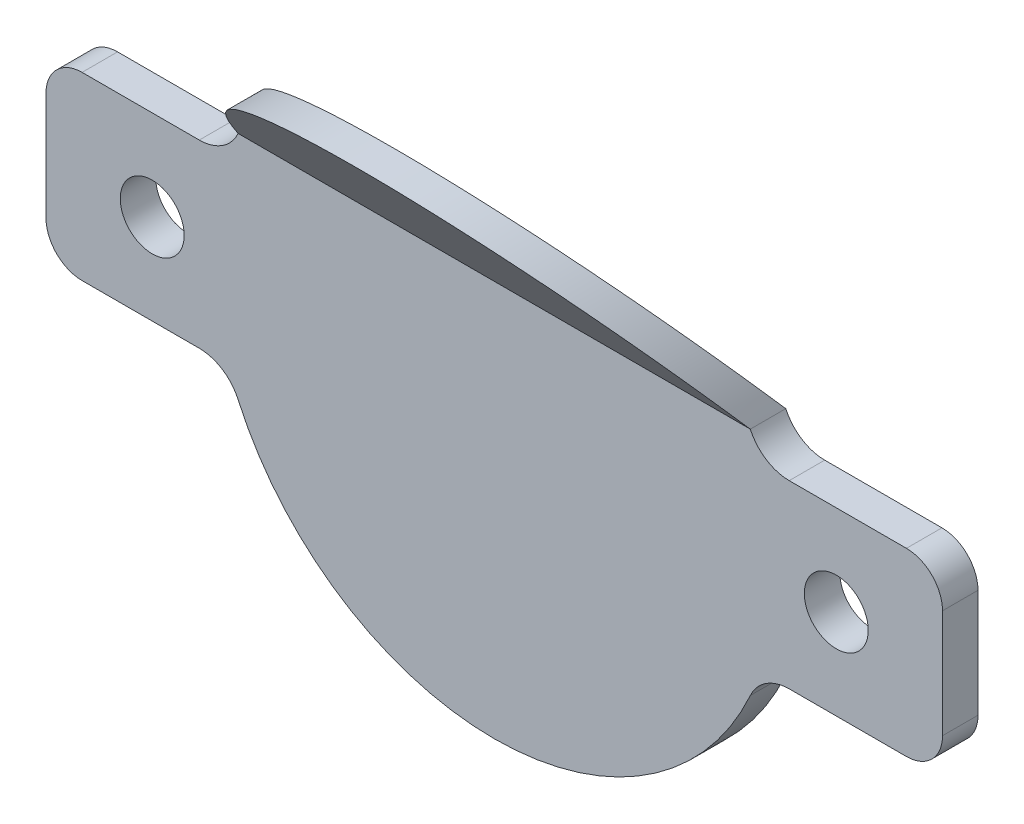
ISO-10303-21;
HEADER;
FILE_DESCRIPTION(('STEP AP214'),'2;1');
FILE_NAME('part.step','',(''),(''),'','','');
FILE_SCHEMA(('AUTOMOTIVE_DESIGN { 1 0 10303 214 1 1 1 1 }'));
ENDSEC;
DATA;
#1=APPLICATION_CONTEXT('core data for automotive mechanical design processes');
#2=APPLICATION_PROTOCOL_DEFINITION('international standard','automotive_design',2000,#1);
#3=PRODUCT_CONTEXT('',#1,'mechanical');
#4=PRODUCT('Part','Part','',(#3));
#5=PRODUCT_RELATED_PRODUCT_CATEGORY('part','',(#4));
#6=PRODUCT_DEFINITION_FORMATION('','',#4);
#7=PRODUCT_DEFINITION_CONTEXT('part definition',#1,'design');
#8=PRODUCT_DEFINITION('design','',#6,#7);
#9=PRODUCT_DEFINITION_SHAPE('','',#8);
#10=(LENGTH_UNIT() NAMED_UNIT(*) SI_UNIT(.MILLI.,.METRE.));
#11=(NAMED_UNIT(*) PLANE_ANGLE_UNIT() SI_UNIT($,.RADIAN.));
#12=(NAMED_UNIT(*) SI_UNIT($,.STERADIAN.) SOLID_ANGLE_UNIT());
#13=UNCERTAINTY_MEASURE_WITH_UNIT(LENGTH_MEASURE(1.E-05),#10,'distance_accuracy_value','');
#14=(GEOMETRIC_REPRESENTATION_CONTEXT(3) GLOBAL_UNCERTAINTY_ASSIGNED_CONTEXT((#13)) GLOBAL_UNIT_ASSIGNED_CONTEXT((#10,
#11,#12)) REPRESENTATION_CONTEXT('',''));
#15=CARTESIAN_POINT('',(0.,0.,0.));
#16=DIRECTION('',(0.,0.,1.));
#17=DIRECTION('',(1.,0.,0.));
#18=AXIS2_PLACEMENT_3D('',#15,#16,#17);
#19=CARTESIAN_POINT('',(17.5163864642521,21.969559393188,9.58000000000002));
#20=DIRECTION('',(0.,0.634780547963298,-0.772692471768307));
#21=DIRECTION('',(0.,0.772692471768307,0.634780547963298));
#22=AXIS2_PLACEMENT_3D('',#19,#20,#21);
#23=PLANE('',#22);
#24=CARTESIAN_POINT('',(-0.514545782896204,2.18955939318798,-6.66962025316452));
#25=DIRECTION('',(0.,0.634780547963298,-0.772692471768307));
#26=DIRECTION('',(0.,-0.772692471768307,-0.634780547963298));
#27=AXIS2_PLACEMENT_3D('',#24,#25,#26);
#28=ELLIPSE('',#27,25.5987999400764,19.78);
#29=CARTESIAN_POINT('',(-18.5516135357479,10.3082161096059,0.));
#30=VERTEX_POINT('',#29);
#31=CARTESIAN_POINT('',(17.5192464305192,10.3125425261282,0.00215433874896024));
#32=VERTEX_POINT('',#31);
#33=EDGE_CURVE('E185',#30,#32,#28,.T.);
#34=ORIENTED_EDGE('',*,*,#33,.T.);
#35=DIRECTION('',(1.,0.,0.));
#36=VECTOR('',#35,1.);
#37=CARTESIAN_POINT('',(0.,10.3082161096059,0.));
#38=LINE('',#37,#36);
#39=EDGE_CURVE('E206',#30,#32,#38,.T.);
#40=ORIENTED_EDGE('',*,*,#39,.F.);
#41=EDGE_LOOP('',(#34,#40));
#42=FACE_BOUND('',#41,.T.);
#43=ADVANCED_FACE('F57',(#42),#23,.T.);
#44=CARTESIAN_POINT('',(17.5163864642521,10.3082161096059,2.50000000000005));
#45=DIRECTION('',(0.,-0.634780547963298,0.772692471768307));
#46=DIRECTION('',(0.,-0.772692471768307,-0.634780547963298));
#47=AXIS2_PLACEMENT_3D('',#44,#45,#46);
#48=PLANE('',#47);
#49=DIRECTION('',(1.,0.,0.));
#50=VECTOR('',#49,1.);
#51=CARTESIAN_POINT('',(0.,10.3082161096059,2.5));
#52=LINE('',#51,#50);
#53=CARTESIAN_POINT('',(-18.5516135357479,10.3082161096059,2.50000000000001));
#54=VERTEX_POINT('',#53);
#55=CARTESIAN_POINT('',(17.5192464305192,10.3125425261282,2.50215433874897));
#56=VERTEX_POINT('',#55);
#57=EDGE_CURVE('E190',#54,#56,#52,.T.);
#58=ORIENTED_EDGE('',*,*,#57,.T.);
#59=CARTESIAN_POINT('',(-0.514545782896204,2.18955939318798,-4.16962025316452));
#60=DIRECTION('',(0.,-0.634780547963298,0.772692471768307));
#61=DIRECTION('',(0.,-0.772692471768307,-0.634780547963298));
#62=AXIS2_PLACEMENT_3D('',#59,#60,#61);
#63=ELLIPSE('',#62,25.5987999400764,19.78);
#64=EDGE_CURVE('E174',#56,#54,#63,.T.);
#65=ORIENTED_EDGE('',*,*,#64,.T.);
#66=EDGE_LOOP('',(#58,#65));
#67=FACE_BOUND('',#66,.T.);
#68=ADVANCED_FACE('F204',(#67),#48,.T.);
#69=CARTESIAN_POINT('',(0.,0.,2.5));
#70=DIRECTION('',(0.,0.,1.));
#71=DIRECTION('',(1.,0.,0.));
#72=AXIS2_PLACEMENT_3D('',#69,#70,#71);
#73=PLANE('',#72);
#74=CARTESIAN_POINT('',(-24.6024947889799,2.18955939318799,2.5));
#75=DIRECTION('',(0.,0.,1.));
#76=DIRECTION('',(1.,0.,0.));
#77=AXIS2_PLACEMENT_3D('',#74,#75,#76);
#78=CIRCLE('',#77,2.24999999999999);
#79=CARTESIAN_POINT('',(-22.3524947889799,2.18955939318799,2.5));
#80=VERTEX_POINT('',#79);
#81=EDGE_CURVE('E230',#80,#80,#78,.T.);
#82=ORIENTED_EDGE('',*,*,#81,.F.);
#83=EDGE_LOOP('',(#82));
#84=FACE_BOUND('',#83,.T.);
#85=CARTESIAN_POINT('',(23.5734032231875,2.18955939318799,2.5));
#86=DIRECTION('',(0.,0.,1.));
#87=DIRECTION('',(1.,0.,0.));
#88=AXIS2_PLACEMENT_3D('',#85,#86,#87);
#89=CIRCLE('',#88,2.24999999999999);
#90=CARTESIAN_POINT('',(25.8234032231875,2.18955939318799,2.5));
#91=VERTEX_POINT('',#90);
#92=EDGE_CURVE('E237',#91,#91,#89,.T.);
#93=ORIENTED_EDGE('',*,*,#92,.F.);
#94=EDGE_LOOP('',(#93));
#95=FACE_BOUND('',#94,.T.);
#96=CARTESIAN_POINT('',(20.2581743086084,11.539559393188,2.5));
#97=DIRECTION('',(0.,0.,1.));
#98=DIRECTION('',(1.,0.,0.));
#99=AXIS2_PLACEMENT_3D('',#96,#97,#98);
#100=CIRCLE('',#99,3.);
#101=CARTESIAN_POINT('',(20.2581743086084,8.53955939318799,2.5));
#102=VERTEX_POINT('',#101);
#103=EDGE_CURVE('E188',#102,#56,#100,.F.);
#104=ORIENTED_EDGE('',*,*,#103,.T.);
#105=ORIENTED_EDGE('',*,*,#57,.F.);
#106=CARTESIAN_POINT('',(-21.2872658744008,11.539559393188,2.5));
#107=DIRECTION('',(0.,0.,1.));
#108=DIRECTION('',(1.,0.,0.));
#109=AXIS2_PLACEMENT_3D('',#106,#107,#108);
#110=CIRCLE('',#109,3.);
#111=CARTESIAN_POINT('',(-21.2872658744008,8.53955939318799,2.5));
#112=VERTEX_POINT('',#111);
#113=EDGE_CURVE('E66',#54,#112,#110,.F.);
#114=ORIENTED_EDGE('',*,*,#113,.T.);
#115=DIRECTION('',(1.,0.,0.));
#116=VECTOR('',#115,1.);
#117=CARTESIAN_POINT('',(0.,8.53955939318799,2.5));
#118=LINE('',#117,#116);
#119=CARTESIAN_POINT('',(-29.5430388201736,8.53955939318799,2.5));
#120=VERTEX_POINT('',#119);
#121=EDGE_CURVE('E253',#120,#112,#118,.T.);
#122=ORIENTED_EDGE('',*,*,#121,.F.);
#123=CARTESIAN_POINT('',(-29.5430388201736,5.99955939318799,2.5));
#124=DIRECTION('',(0.,0.,1.));
#125=DIRECTION('',(1.,0.,0.));
#126=AXIS2_PLACEMENT_3D('',#123,#124,#125);
#127=CIRCLE('',#126,2.54);
#128=CARTESIAN_POINT('',(-32.0830388201736,5.99955939318799,2.5));
#129=VERTEX_POINT('',#128);
#130=EDGE_CURVE('E292',#120,#129,#127,.T.);
#131=ORIENTED_EDGE('',*,*,#130,.T.);
#132=DIRECTION('',(0.,1.,0.));
#133=VECTOR('',#132,1.);
#134=CARTESIAN_POINT('',(-32.0830388201736,0.,2.5));
#135=LINE('',#134,#133);
#136=CARTESIAN_POINT('',(-32.0830388201736,-1.62044060681201,2.5));
#137=VERTEX_POINT('',#136);
#138=EDGE_CURVE('E255',#137,#129,#135,.T.);
#139=ORIENTED_EDGE('',*,*,#138,.F.);
#140=CARTESIAN_POINT('',(-29.5430388201736,-1.62044060681201,2.5));
#141=DIRECTION('',(0.,0.,1.));
#142=DIRECTION('',(1.,0.,0.));
#143=AXIS2_PLACEMENT_3D('',#140,#141,#142);
#144=CIRCLE('',#143,2.54);
#145=CARTESIAN_POINT('',(-29.5430388201736,-4.16044060681201,2.5));
#146=VERTEX_POINT('',#145);
#147=EDGE_CURVE('E294',#137,#146,#144,.T.);
#148=ORIENTED_EDGE('',*,*,#147,.T.);
#149=DIRECTION('',(-1.,0.,0.));
#150=VECTOR('',#149,1.);
#151=CARTESIAN_POINT('',(0.,-4.16044060681201,2.5));
#152=LINE('',#151,#150);
#153=CARTESIAN_POINT('',(-21.2872658744008,-4.16044060681201,2.5));
#154=VERTEX_POINT('',#153);
#155=EDGE_CURVE('E244',#154,#146,#152,.T.);
#156=ORIENTED_EDGE('',*,*,#155,.F.);
#157=CARTESIAN_POINT('',(-21.2872658744008,-7.16044060681201,2.5));
#158=DIRECTION('',(0.,0.,1.));
#159=DIRECTION('',(1.,0.,0.));
#160=AXIS2_PLACEMENT_3D('',#157,#158,#159);
#161=CIRCLE('',#160,3.);
#162=CARTESIAN_POINT('',(-18.5516135357479,-5.92909732322992,2.5));
#163=VERTEX_POINT('',#162);
#164=EDGE_CURVE('E223',#154,#163,#161,.F.);
#165=ORIENTED_EDGE('',*,*,#164,.T.);
#166=CARTESIAN_POINT('',(-0.514545782896191,2.18955939318799,2.5));
#167=DIRECTION('',(0.,0.,1.));
#168=DIRECTION('',(1.,0.,0.));
#169=AXIS2_PLACEMENT_3D('',#166,#167,#168);
#170=CIRCLE('',#169,19.78);
#171=CARTESIAN_POINT('',(17.5225219699555,-5.92909732322992,2.5));
#172=VERTEX_POINT('',#171);
#173=EDGE_CURVE('E205',#163,#172,#170,.T.);
#174=ORIENTED_EDGE('',*,*,#173,.T.);
#175=CARTESIAN_POINT('',(20.2581743086084,-7.16044060681201,2.5));
#176=DIRECTION('',(0.,0.,1.));
#177=DIRECTION('',(1.,0.,0.));
#178=AXIS2_PLACEMENT_3D('',#175,#176,#177);
#179=CIRCLE('',#178,3.);
#180=CARTESIAN_POINT('',(20.2581743086084,-4.16044060681201,2.5));
#181=VERTEX_POINT('',#180);
#182=EDGE_CURVE('E323',#172,#181,#179,.F.);
#183=ORIENTED_EDGE('',*,*,#182,.T.);
#184=DIRECTION('',(1.,0.,0.));
#185=VECTOR('',#184,1.);
#186=CARTESIAN_POINT('',(0.,-4.16044060681201,2.5));
#187=LINE('',#186,#185);
#188=CARTESIAN_POINT('',(28.5139472543812,-4.16044060681201,2.5));
#189=VERTEX_POINT('',#188);
#190=EDGE_CURVE('E246',#181,#189,#187,.T.);
#191=ORIENTED_EDGE('',*,*,#190,.T.);
#192=CARTESIAN_POINT('',(28.5139472543812,-1.62044060681201,2.5));
#193=DIRECTION('',(0.,0.,1.));
#194=DIRECTION('',(1.,0.,0.));
#195=AXIS2_PLACEMENT_3D('',#192,#193,#194);
#196=CIRCLE('',#195,2.54);
#197=CARTESIAN_POINT('',(31.0539472543812,-1.62044060681201,2.5));
#198=VERTEX_POINT('',#197);
#199=EDGE_CURVE('E288',#189,#198,#196,.T.);
#200=ORIENTED_EDGE('',*,*,#199,.T.);
#201=DIRECTION('',(0.,1.,0.));
#202=VECTOR('',#201,1.);
#203=CARTESIAN_POINT('',(31.0539472543812,0.,2.5));
#204=LINE('',#203,#202);
#205=CARTESIAN_POINT('',(31.0539472543812,5.99955939318799,2.5));
#206=VERTEX_POINT('',#205);
#207=EDGE_CURVE('E249',#198,#206,#204,.T.);
#208=ORIENTED_EDGE('',*,*,#207,.T.);
#209=CARTESIAN_POINT('',(28.5139472543812,5.99955939318799,2.5));
#210=DIRECTION('',(0.,0.,1.));
#211=DIRECTION('',(1.,0.,0.));
#212=AXIS2_PLACEMENT_3D('',#209,#210,#211);
#213=CIRCLE('',#212,2.54);
#214=CARTESIAN_POINT('',(28.5139472543812,8.53955939318799,2.5));
#215=VERTEX_POINT('',#214);
#216=EDGE_CURVE('E290',#206,#215,#213,.T.);
#217=ORIENTED_EDGE('',*,*,#216,.T.);
#218=DIRECTION('',(-1.,0.,0.));
#219=VECTOR('',#218,1.);
#220=CARTESIAN_POINT('',(0.,8.53955939318799,2.5));
#221=LINE('',#220,#219);
#222=EDGE_CURVE('E192',#215,#102,#221,.T.);
#223=ORIENTED_EDGE('',*,*,#222,.T.);
#224=EDGE_LOOP('',(#104,#105,#114,#122,#131,#139,#148,#156,#165,#174,#183,#191,#200,#208,#217,#223));
#225=FACE_BOUND('',#224,.T.);
#226=ADVANCED_FACE('F189',(#84,#95,#225),#73,.T.);
#227=CARTESIAN_POINT('',(0.,0.,0.));
#228=DIRECTION('',(0.,0.,1.));
#229=DIRECTION('',(1.,0.,0.));
#230=AXIS2_PLACEMENT_3D('',#227,#228,#229);
#231=PLANE('',#230);
#232=CARTESIAN_POINT('',(23.5734032231875,2.18955939318799,0.));
#233=DIRECTION('',(0.,0.,1.));
#234=DIRECTION('',(1.,0.,0.));
#235=AXIS2_PLACEMENT_3D('',#232,#233,#234);
#236=CIRCLE('',#235,2.25);
#237=CARTESIAN_POINT('',(25.8234032231875,2.18955939318799,0.));
#238=VERTEX_POINT('',#237);
#239=EDGE_CURVE('E240',#238,#238,#236,.T.);
#240=ORIENTED_EDGE('',*,*,#239,.T.);
#241=EDGE_LOOP('',(#240));
#242=FACE_BOUND('',#241,.T.);
#243=CARTESIAN_POINT('',(-24.6024947889799,2.18955939318799,0.));
#244=DIRECTION('',(0.,0.,1.));
#245=DIRECTION('',(1.,0.,0.));
#246=AXIS2_PLACEMENT_3D('',#243,#244,#245);
#247=CIRCLE('',#246,2.25);
#248=CARTESIAN_POINT('',(-22.3524947889799,2.18955939318799,0.));
#249=VERTEX_POINT('',#248);
#250=EDGE_CURVE('E234',#249,#249,#247,.T.);
#251=ORIENTED_EDGE('',*,*,#250,.T.);
#252=EDGE_LOOP('',(#251));
#253=FACE_BOUND('',#252,.T.);
#254=ORIENTED_EDGE('',*,*,#39,.T.);
#255=CARTESIAN_POINT('',(20.2581743086084,11.539559393188,0.));
#256=DIRECTION('',(0.,0.,1.));
#257=DIRECTION('',(1.,0.,0.));
#258=AXIS2_PLACEMENT_3D('',#255,#256,#257);
#259=CIRCLE('',#258,3.);
#260=CARTESIAN_POINT('',(20.2581743086084,8.53955939318799,0.));
#261=VERTEX_POINT('',#260);
#262=EDGE_CURVE('E196',#32,#261,#259,.T.);
#263=ORIENTED_EDGE('',*,*,#262,.T.);
#264=DIRECTION('',(-1.,0.,0.));
#265=VECTOR('',#264,1.);
#266=CARTESIAN_POINT('',(0.,8.53955939318799,0.));
#267=LINE('',#266,#265);
#268=CARTESIAN_POINT('',(28.5139472543812,8.53955939318799,0.));
#269=VERTEX_POINT('',#268);
#270=EDGE_CURVE('E265',#269,#261,#267,.T.);
#271=ORIENTED_EDGE('',*,*,#270,.F.);
#272=CARTESIAN_POINT('',(28.5139472543812,5.99955939318799,0.));
#273=DIRECTION('',(0.,0.,1.));
#274=DIRECTION('',(1.,0.,0.));
#275=AXIS2_PLACEMENT_3D('',#272,#273,#274);
#276=CIRCLE('',#275,2.54);
#277=CARTESIAN_POINT('',(31.0539472543812,5.99955939318799,0.));
#278=VERTEX_POINT('',#277);
#279=EDGE_CURVE('E277',#269,#278,#276,.F.);
#280=ORIENTED_EDGE('',*,*,#279,.T.);
#281=DIRECTION('',(0.,1.,0.));
#282=VECTOR('',#281,1.);
#283=CARTESIAN_POINT('',(31.0539472543812,0.,0.));
#284=LINE('',#283,#282);
#285=CARTESIAN_POINT('',(31.0539472543812,-1.62044060681201,0.));
#286=VERTEX_POINT('',#285);
#287=EDGE_CURVE('E262',#286,#278,#284,.T.);
#288=ORIENTED_EDGE('',*,*,#287,.F.);
#289=CARTESIAN_POINT('',(28.5139472543812,-1.62044060681201,0.));
#290=DIRECTION('',(0.,0.,1.));
#291=DIRECTION('',(1.,0.,0.));
#292=AXIS2_PLACEMENT_3D('',#289,#290,#291);
#293=CIRCLE('',#292,2.54);
#294=CARTESIAN_POINT('',(28.5139472543812,-4.16044060681201,0.));
#295=VERTEX_POINT('',#294);
#296=EDGE_CURVE('E274',#286,#295,#293,.F.);
#297=ORIENTED_EDGE('',*,*,#296,.T.);
#298=DIRECTION('',(1.,0.,0.));
#299=VECTOR('',#298,1.);
#300=CARTESIAN_POINT('',(0.,-4.16044060681201,0.));
#301=LINE('',#300,#299);
#302=CARTESIAN_POINT('',(20.2581743086084,-4.16044060681201,0.));
#303=VERTEX_POINT('',#302);
#304=EDGE_CURVE('E260',#303,#295,#301,.T.);
#305=ORIENTED_EDGE('',*,*,#304,.F.);
#306=CARTESIAN_POINT('',(20.2581743086084,-7.16044060681201,0.));
#307=DIRECTION('',(0.,0.,1.));
#308=DIRECTION('',(1.,0.,0.));
#309=AXIS2_PLACEMENT_3D('',#306,#307,#308);
#310=CIRCLE('',#309,3.);
#311=CARTESIAN_POINT('',(17.5225219699555,-5.92909732322992,0.));
#312=VERTEX_POINT('',#311);
#313=EDGE_CURVE('E197',#303,#312,#310,.T.);
#314=ORIENTED_EDGE('',*,*,#313,.T.);
#315=CARTESIAN_POINT('',(-0.514545782896191,2.18955939318799,0.));
#316=DIRECTION('',(0.,0.,1.));
#317=DIRECTION('',(1.,0.,0.));
#318=AXIS2_PLACEMENT_3D('',#315,#316,#317);
#319=CIRCLE('',#318,19.78);
#320=CARTESIAN_POINT('',(-18.5516135357479,-5.92909732322992,0.));
#321=VERTEX_POINT('',#320);
#322=EDGE_CURVE('E209',#321,#312,#319,.T.);
#323=ORIENTED_EDGE('',*,*,#322,.F.);
#324=CARTESIAN_POINT('',(-21.2872658744008,-7.16044060681201,0.));
#325=DIRECTION('',(0.,0.,1.));
#326=DIRECTION('',(1.,0.,0.));
#327=AXIS2_PLACEMENT_3D('',#324,#325,#326);
#328=CIRCLE('',#327,3.);
#329=CARTESIAN_POINT('',(-21.2872658744008,-4.16044060681201,0.));
#330=VERTEX_POINT('',#329);
#331=EDGE_CURVE('E327',#321,#330,#328,.T.);
#332=ORIENTED_EDGE('',*,*,#331,.T.);
#333=DIRECTION('',(-1.,0.,0.));
#334=VECTOR('',#333,1.);
#335=CARTESIAN_POINT('',(0.,-4.16044060681201,0.));
#336=LINE('',#335,#334);
#337=CARTESIAN_POINT('',(-29.5430388201736,-4.16044060681201,0.));
#338=VERTEX_POINT('',#337);
#339=EDGE_CURVE('E243',#330,#338,#336,.T.);
#340=ORIENTED_EDGE('',*,*,#339,.T.);
#341=CARTESIAN_POINT('',(-29.5430388201736,-1.62044060681201,0.));
#342=DIRECTION('',(0.,0.,1.));
#343=DIRECTION('',(1.,0.,0.));
#344=AXIS2_PLACEMENT_3D('',#341,#342,#343);
#345=CIRCLE('',#344,2.54);
#346=CARTESIAN_POINT('',(-32.0830388201736,-1.62044060681201,0.));
#347=VERTEX_POINT('',#346);
#348=EDGE_CURVE('E281',#338,#347,#345,.F.);
#349=ORIENTED_EDGE('',*,*,#348,.T.);
#350=DIRECTION('',(0.,1.,0.));
#351=VECTOR('',#350,1.);
#352=CARTESIAN_POINT('',(-32.0830388201736,0.,0.));
#353=LINE('',#352,#351);
#354=CARTESIAN_POINT('',(-32.0830388201736,5.99955939318799,0.));
#355=VERTEX_POINT('',#354);
#356=EDGE_CURVE('E247',#347,#355,#353,.T.);
#357=ORIENTED_EDGE('',*,*,#356,.T.);
#358=CARTESIAN_POINT('',(-29.5430388201736,5.99955939318799,0.));
#359=DIRECTION('',(0.,0.,1.));
#360=DIRECTION('',(1.,0.,0.));
#361=AXIS2_PLACEMENT_3D('',#358,#359,#360);
#362=CIRCLE('',#361,2.54);
#363=CARTESIAN_POINT('',(-29.5430388201736,8.53955939318799,0.));
#364=VERTEX_POINT('',#363);
#365=EDGE_CURVE('E279',#355,#364,#362,.F.);
#366=ORIENTED_EDGE('',*,*,#365,.T.);
#367=DIRECTION('',(1.,0.,0.));
#368=VECTOR('',#367,1.);
#369=CARTESIAN_POINT('',(0.,8.53955939318799,0.));
#370=LINE('',#369,#368);
#371=CARTESIAN_POINT('',(-21.2872658744008,8.53955939318799,0.));
#372=VERTEX_POINT('',#371);
#373=EDGE_CURVE('E268',#364,#372,#370,.T.);
#374=ORIENTED_EDGE('',*,*,#373,.T.);
#375=CARTESIAN_POINT('',(-21.2872658744008,11.539559393188,0.));
#376=DIRECTION('',(0.,0.,1.));
#377=DIRECTION('',(1.,0.,0.));
#378=AXIS2_PLACEMENT_3D('',#375,#376,#377);
#379=CIRCLE('',#378,3.);
#380=EDGE_CURVE('E12',#372,#30,#379,.T.);
#381=ORIENTED_EDGE('',*,*,#380,.T.);
#382=EDGE_LOOP('',(#254,#263,#271,#280,#288,#297,#305,#314,#323,#332,#340,#349,#357,#366,#374,#381));
#383=FACE_BOUND('',#382,.T.);
#384=ADVANCED_FACE('F333',(#242,#253,#383),#231,.F.);
#385=CARTESIAN_POINT('',(0.,-4.16044060681201,2.5));
#386=DIRECTION('',(0.,-1.,0.));
#387=DIRECTION('',(0.,0.,-1.));
#388=AXIS2_PLACEMENT_3D('',#385,#386,#387);
#389=PLANE('',#388);
#390=ORIENTED_EDGE('',*,*,#339,.F.);
#391=DIRECTION('',(0.,0.,-1.));
#392=VECTOR('',#391,1.);
#393=CARTESIAN_POINT('',(-21.2872658744008,-4.16044060681201,2.5));
#394=LINE('',#393,#392);
#395=EDGE_CURVE('E202',#330,#154,#394,.F.);
#396=ORIENTED_EDGE('',*,*,#395,.T.);
#397=ORIENTED_EDGE('',*,*,#155,.T.);
#398=DIRECTION('',(0.,0.,-1.));
#399=VECTOR('',#398,1.);
#400=CARTESIAN_POINT('',(-29.5430388201736,-4.16044060681201,2.5));
#401=LINE('',#400,#399);
#402=EDGE_CURVE('E258',#146,#338,#401,.T.);
#403=ORIENTED_EDGE('',*,*,#402,.T.);
#404=EDGE_LOOP('',(#390,#396,#397,#403));
#405=FACE_BOUND('',#404,.T.);
#406=ADVANCED_FACE('F339',(#405),#389,.T.);
#407=CARTESIAN_POINT('',(0.,-4.16044060681201,2.5));
#408=DIRECTION('',(0.,1.,0.));
#409=DIRECTION('',(0.,0.,1.));
#410=AXIS2_PLACEMENT_3D('',#407,#408,#409);
#411=PLANE('',#410);
#412=ORIENTED_EDGE('',*,*,#190,.F.);
#413=DIRECTION('',(0.,0.,1.));
#414=VECTOR('',#413,1.);
#415=CARTESIAN_POINT('',(20.2581743086084,-4.16044060681201,2.5));
#416=LINE('',#415,#414);
#417=EDGE_CURVE('E315',#181,#303,#416,.F.);
#418=ORIENTED_EDGE('',*,*,#417,.T.);
#419=ORIENTED_EDGE('',*,*,#304,.T.);
#420=DIRECTION('',(0.,0.,-1.));
#421=VECTOR('',#420,1.);
#422=CARTESIAN_POINT('',(28.5139472543812,-4.16044060681201,2.5));
#423=LINE('',#422,#421);
#424=EDGE_CURVE('E307',#295,#189,#423,.F.);
#425=ORIENTED_EDGE('',*,*,#424,.T.);
#426=EDGE_LOOP('',(#412,#418,#419,#425));
#427=FACE_BOUND('',#426,.T.);
#428=ADVANCED_FACE('F353',(#427),#411,.F.);
#429=CARTESIAN_POINT('',(31.0539472543812,0.,2.5));
#430=DIRECTION('',(-1.,0.,0.));
#431=DIRECTION('',(0.,0.,1.));
#432=AXIS2_PLACEMENT_3D('',#429,#430,#431);
#433=PLANE('',#432);
#434=ORIENTED_EDGE('',*,*,#287,.T.);
#435=DIRECTION('',(0.,0.,-1.));
#436=VECTOR('',#435,1.);
#437=CARTESIAN_POINT('',(31.0539472543812,5.99955939318799,2.5));
#438=LINE('',#437,#436);
#439=EDGE_CURVE('E305',#278,#206,#438,.F.);
#440=ORIENTED_EDGE('',*,*,#439,.T.);
#441=ORIENTED_EDGE('',*,*,#207,.F.);
#442=DIRECTION('',(0.,0.,-1.));
#443=VECTOR('',#442,1.);
#444=CARTESIAN_POINT('',(31.0539472543812,-1.62044060681201,2.5));
#445=LINE('',#444,#443);
#446=EDGE_CURVE('E302',#198,#286,#445,.T.);
#447=ORIENTED_EDGE('',*,*,#446,.T.);
#448=EDGE_LOOP('',(#434,#440,#441,#447));
#449=FACE_BOUND('',#448,.T.);
#450=ADVANCED_FACE('F363',(#449),#433,.F.);
#451=CARTESIAN_POINT('',(0.,8.53955939318799,2.5));
#452=DIRECTION('',(0.,-1.,0.));
#453=DIRECTION('',(0.,0.,-1.));
#454=AXIS2_PLACEMENT_3D('',#451,#452,#453);
#455=PLANE('',#454);
#456=ORIENTED_EDGE('',*,*,#270,.T.);
#457=DIRECTION('',(0.,0.,1.));
#458=VECTOR('',#457,1.);
#459=CARTESIAN_POINT('',(20.2581743086084,8.53955939318799,2.5));
#460=LINE('',#459,#458);
#461=EDGE_CURVE('E317',#261,#102,#460,.T.);
#462=ORIENTED_EDGE('',*,*,#461,.T.);
#463=ORIENTED_EDGE('',*,*,#222,.F.);
#464=DIRECTION('',(0.,0.,-1.));
#465=VECTOR('',#464,1.);
#466=CARTESIAN_POINT('',(28.5139472543812,8.53955939318799,2.5));
#467=LINE('',#466,#465);
#468=EDGE_CURVE('E299',#215,#269,#467,.T.);
#469=ORIENTED_EDGE('',*,*,#468,.T.);
#470=EDGE_LOOP('',(#456,#462,#463,#469));
#471=FACE_BOUND('',#470,.T.);
#472=ADVANCED_FACE('F370',(#471),#455,.F.);
#473=CARTESIAN_POINT('',(0.,8.53955939318799,2.5));
#474=DIRECTION('',(0.,1.,0.));
#475=DIRECTION('',(0.,0.,1.));
#476=AXIS2_PLACEMENT_3D('',#473,#474,#475);
#477=PLANE('',#476);
#478=ORIENTED_EDGE('',*,*,#121,.T.);
#479=DIRECTION('',(0.,0.,-1.));
#480=VECTOR('',#479,1.);
#481=CARTESIAN_POINT('',(-21.2872658744008,8.53955939318799,0.));
#482=LINE('',#481,#480);
#483=EDGE_CURVE('E80',#112,#372,#482,.T.);
#484=ORIENTED_EDGE('',*,*,#483,.T.);
#485=ORIENTED_EDGE('',*,*,#373,.F.);
#486=DIRECTION('',(0.,0.,-1.));
#487=VECTOR('',#486,1.);
#488=CARTESIAN_POINT('',(-29.5430388201736,8.53955939318799,2.5));
#489=LINE('',#488,#487);
#490=EDGE_CURVE('E297',#364,#120,#489,.F.);
#491=ORIENTED_EDGE('',*,*,#490,.T.);
#492=EDGE_LOOP('',(#478,#484,#485,#491));
#493=FACE_BOUND('',#492,.T.);
#494=ADVANCED_FACE('F410',(#493),#477,.T.);
#495=CARTESIAN_POINT('',(-32.0830388201736,0.,2.5));
#496=DIRECTION('',(-1.,0.,0.));
#497=DIRECTION('',(0.,0.,1.));
#498=AXIS2_PLACEMENT_3D('',#495,#496,#497);
#499=PLANE('',#498);
#500=ORIENTED_EDGE('',*,*,#356,.F.);
#501=DIRECTION('',(0.,0.,-1.));
#502=VECTOR('',#501,1.);
#503=CARTESIAN_POINT('',(-32.0830388201736,-1.62044060681201,2.5));
#504=LINE('',#503,#502);
#505=EDGE_CURVE('E286',#347,#137,#504,.F.);
#506=ORIENTED_EDGE('',*,*,#505,.T.);
#507=ORIENTED_EDGE('',*,*,#138,.T.);
#508=DIRECTION('',(0.,0.,-1.));
#509=VECTOR('',#508,1.);
#510=CARTESIAN_POINT('',(-32.0830388201736,5.99955939318799,2.5));
#511=LINE('',#510,#509);
#512=EDGE_CURVE('E283',#129,#355,#511,.T.);
#513=ORIENTED_EDGE('',*,*,#512,.T.);
#514=EDGE_LOOP('',(#500,#506,#507,#513));
#515=FACE_BOUND('',#514,.T.);
#516=ADVANCED_FACE('F406',(#515),#499,.T.);
#517=CARTESIAN_POINT('',(-29.5430388201736,-1.62044060681201,2.5));
#518=DIRECTION('',(0.,0.,-1.));
#519=DIRECTION('',(-1.,0.,0.));
#520=AXIS2_PLACEMENT_3D('',#517,#518,#519);
#521=CYLINDRICAL_SURFACE('',#520,2.54);
#522=ORIENTED_EDGE('',*,*,#147,.F.);
#523=ORIENTED_EDGE('',*,*,#505,.F.);
#524=ORIENTED_EDGE('',*,*,#348,.F.);
#525=ORIENTED_EDGE('',*,*,#402,.F.);
#526=EDGE_LOOP('',(#522,#523,#524,#525));
#527=FACE_BOUND('',#526,.T.);
#528=ADVANCED_FACE('F409',(#527),#521,.T.);
#529=CARTESIAN_POINT('',(-29.5430388201736,5.99955939318799,2.5));
#530=DIRECTION('',(0.,0.,-1.));
#531=DIRECTION('',(-1.,0.,0.));
#532=AXIS2_PLACEMENT_3D('',#529,#530,#531);
#533=CYLINDRICAL_SURFACE('',#532,2.54);
#534=ORIENTED_EDGE('',*,*,#130,.F.);
#535=ORIENTED_EDGE('',*,*,#490,.F.);
#536=ORIENTED_EDGE('',*,*,#365,.F.);
#537=ORIENTED_EDGE('',*,*,#512,.F.);
#538=EDGE_LOOP('',(#534,#535,#536,#537));
#539=FACE_BOUND('',#538,.T.);
#540=ADVANCED_FACE('F424',(#539),#533,.T.);
#541=CARTESIAN_POINT('',(28.5139472543812,5.99955939318799,2.5));
#542=DIRECTION('',(0.,0.,-1.));
#543=DIRECTION('',(-1.,0.,0.));
#544=AXIS2_PLACEMENT_3D('',#541,#542,#543);
#545=CYLINDRICAL_SURFACE('',#544,2.54);
#546=ORIENTED_EDGE('',*,*,#216,.F.);
#547=ORIENTED_EDGE('',*,*,#439,.F.);
#548=ORIENTED_EDGE('',*,*,#279,.F.);
#549=ORIENTED_EDGE('',*,*,#468,.F.);
#550=EDGE_LOOP('',(#546,#547,#548,#549));
#551=FACE_BOUND('',#550,.T.);
#552=ADVANCED_FACE('F367',(#551),#545,.T.);
#553=CARTESIAN_POINT('',(28.5139472543812,-1.62044060681201,2.5));
#554=DIRECTION('',(0.,0.,-1.));
#555=DIRECTION('',(-1.,0.,0.));
#556=AXIS2_PLACEMENT_3D('',#553,#554,#555);
#557=CYLINDRICAL_SURFACE('',#556,2.54);
#558=ORIENTED_EDGE('',*,*,#199,.F.);
#559=ORIENTED_EDGE('',*,*,#424,.F.);
#560=ORIENTED_EDGE('',*,*,#296,.F.);
#561=ORIENTED_EDGE('',*,*,#446,.F.);
#562=EDGE_LOOP('',(#558,#559,#560,#561));
#563=FACE_BOUND('',#562,.T.);
#564=ADVANCED_FACE('F359',(#563),#557,.T.);
#565=CARTESIAN_POINT('',(23.5734032231875,2.18955939318799,2.5));
#566=DIRECTION('',(0.,0.,1.));
#567=DIRECTION('',(1.,0.,0.));
#568=AXIS2_PLACEMENT_3D('',#565,#566,#567);
#569=CYLINDRICAL_SURFACE('',#568,2.24999999999999);
#570=ORIENTED_EDGE('',*,*,#239,.F.);
#571=EDGE_LOOP('',(#570));
#572=FACE_BOUND('',#571,.T.);
#573=ORIENTED_EDGE('',*,*,#92,.T.);
#574=EDGE_LOOP('',(#573));
#575=FACE_BOUND('',#574,.T.);
#576=ADVANCED_FACE('F395',(#572,#575),#569,.F.);
#577=CARTESIAN_POINT('',(-24.6024947889799,2.18955939318799,2.5));
#578=DIRECTION('',(0.,0.,1.));
#579=DIRECTION('',(1.,0.,0.));
#580=AXIS2_PLACEMENT_3D('',#577,#578,#579);
#581=CYLINDRICAL_SURFACE('',#580,2.24999999999999);
#582=ORIENTED_EDGE('',*,*,#250,.F.);
#583=EDGE_LOOP('',(#582));
#584=FACE_BOUND('',#583,.T.);
#585=ORIENTED_EDGE('',*,*,#81,.T.);
#586=EDGE_LOOP('',(#585));
#587=FACE_BOUND('',#586,.T.);
#588=ADVANCED_FACE('F392',(#584,#587),#581,.F.);
#589=CARTESIAN_POINT('',(-0.514545782896191,2.18955939318799,0.));
#590=DIRECTION('',(0.,0.,1.));
#591=DIRECTION('',(1.,0.,0.));
#592=AXIS2_PLACEMENT_3D('',#589,#590,#591);
#593=CYLINDRICAL_SURFACE('',#592,19.78);
#594=ORIENTED_EDGE('',*,*,#322,.T.);
#595=DIRECTION('',(0.,0.,1.));
#596=VECTOR('',#595,1.);
#597=CARTESIAN_POINT('',(17.5225219699555,-5.92909732322992,0.));
#598=LINE('',#597,#596);
#599=EDGE_CURVE('E312',#312,#172,#598,.T.);
#600=ORIENTED_EDGE('',*,*,#599,.T.);
#601=ORIENTED_EDGE('',*,*,#173,.F.);
#602=DIRECTION('',(0.,0.,1.));
#603=VECTOR('',#602,1.);
#604=CARTESIAN_POINT('',(-18.5516135357479,-5.92909732322992,0.));
#605=LINE('',#604,#603);
#606=EDGE_CURVE('E310',#163,#321,#605,.F.);
#607=ORIENTED_EDGE('',*,*,#606,.T.);
#608=EDGE_LOOP('',(#594,#600,#601,#607));
#609=FACE_BOUND('',#608,.T.);
#610=ADVANCED_FACE('F345',(#609),#593,.T.);
#611=CARTESIAN_POINT('',(20.2581743086084,-7.16044060681201,0.));
#612=DIRECTION('',(0.,0.,1.));
#613=DIRECTION('',(1.,0.,0.));
#614=AXIS2_PLACEMENT_3D('',#611,#612,#613);
#615=CYLINDRICAL_SURFACE('',#614,3.);
#616=ORIENTED_EDGE('',*,*,#313,.F.);
#617=ORIENTED_EDGE('',*,*,#417,.F.);
#618=ORIENTED_EDGE('',*,*,#182,.F.);
#619=ORIENTED_EDGE('',*,*,#599,.F.);
#620=EDGE_LOOP('',(#616,#617,#618,#619));
#621=FACE_BOUND('',#620,.T.);
#622=ADVANCED_FACE('F349',(#621),#615,.F.);
#623=CARTESIAN_POINT('',(20.2581743086084,11.539559393188,0.));
#624=DIRECTION('',(0.,0.,1.));
#625=DIRECTION('',(1.,0.,0.));
#626=AXIS2_PLACEMENT_3D('',#623,#624,#625);
#627=CYLINDRICAL_SURFACE('',#626,3.);
#628=ORIENTED_EDGE('',*,*,#262,.F.);
#629=CARTESIAN_POINT('',(17.5163864642521,10.3218335092485,2.51118693493571));
#630=DIRECTION('',(0.,0.,-1.));
#631=VECTOR('',#630,1.);
#632=LINE('',#629,#631);
#633=EDGE_CURVE('E178',#56,#32,#632,.T.);
#634=ORIENTED_EDGE('',*,*,#633,.F.);
#635=ORIENTED_EDGE('',*,*,#103,.F.);
#636=ORIENTED_EDGE('',*,*,#461,.F.);
#637=EDGE_LOOP('',(#628,#634,#635,#636));
#638=FACE_BOUND('',#637,.T.);
#639=ADVANCED_FACE('F201',(#638),#627,.F.);
#640=CARTESIAN_POINT('',(-21.2872658744008,-7.16044060681201,0.));
#641=DIRECTION('',(0.,0.,1.));
#642=DIRECTION('',(1.,0.,0.));
#643=AXIS2_PLACEMENT_3D('',#640,#641,#642);
#644=CYLINDRICAL_SURFACE('',#643,3.);
#645=ORIENTED_EDGE('',*,*,#331,.F.);
#646=ORIENTED_EDGE('',*,*,#606,.F.);
#647=ORIENTED_EDGE('',*,*,#164,.F.);
#648=ORIENTED_EDGE('',*,*,#395,.F.);
#649=EDGE_LOOP('',(#645,#646,#647,#648));
#650=FACE_BOUND('',#649,.T.);
#651=ADVANCED_FACE('F342',(#650),#644,.F.);
#652=CARTESIAN_POINT('',(-21.2872658744008,11.539559393188,0.));
#653=DIRECTION('',(0.,0.,1.));
#654=DIRECTION('',(1.,0.,0.));
#655=AXIS2_PLACEMENT_3D('',#652,#653,#654);
#656=CYLINDRICAL_SURFACE('',#655,3.);
#657=ORIENTED_EDGE('',*,*,#380,.F.);
#658=ORIENTED_EDGE('',*,*,#483,.F.);
#659=ORIENTED_EDGE('',*,*,#113,.F.);
#660=DIRECTION('',(0.,0.,1.));
#661=VECTOR('',#660,1.);
#662=CARTESIAN_POINT('',(-18.5516135357479,10.3082161096059,0.));
#663=LINE('',#662,#661);
#664=EDGE_CURVE('E182',#30,#54,#663,.T.);
#665=ORIENTED_EDGE('',*,*,#664,.F.);
#666=EDGE_LOOP('',(#657,#658,#659,#665));
#667=FACE_BOUND('',#666,.T.);
#668=ADVANCED_FACE('F59',(#667),#656,.F.);
#669=CARTESIAN_POINT('',(-0.514545782896204,2.18955939318798,12.080025));
#670=DIRECTION('',(0.,0.,-1.));
#671=DIRECTION('',(-1.,0.,0.));
#672=AXIS2_PLACEMENT_3D('',#669,#670,#671);
#673=CYLINDRICAL_SURFACE('',#672,19.78);
#674=ORIENTED_EDGE('',*,*,#664,.T.);
#675=ORIENTED_EDGE('',*,*,#64,.F.);
#676=ORIENTED_EDGE('',*,*,#633,.T.);
#677=ORIENTED_EDGE('',*,*,#33,.F.);
#678=EDGE_LOOP('',(#674,#675,#676,#677));
#679=FACE_BOUND('',#678,.T.);
#680=ADVANCED_FACE('F176',(#679),#673,.T.);
#681=CLOSED_SHELL('',(#43,#68,#226,#384,#406,#428,#450,#472,#494,#516,#528,#540,#552,#564,#576,
#588,#610,#622,#639,#651,#668,#680));
#682=MANIFOLD_SOLID_BREP('B2',#681);
#683=ADVANCED_BREP_SHAPE_REPRESENTATION('',(#18,#682),#14);
#684=SHAPE_DEFINITION_REPRESENTATION(#9,#683);
ENDSEC;
END-ISO-10303-21;
